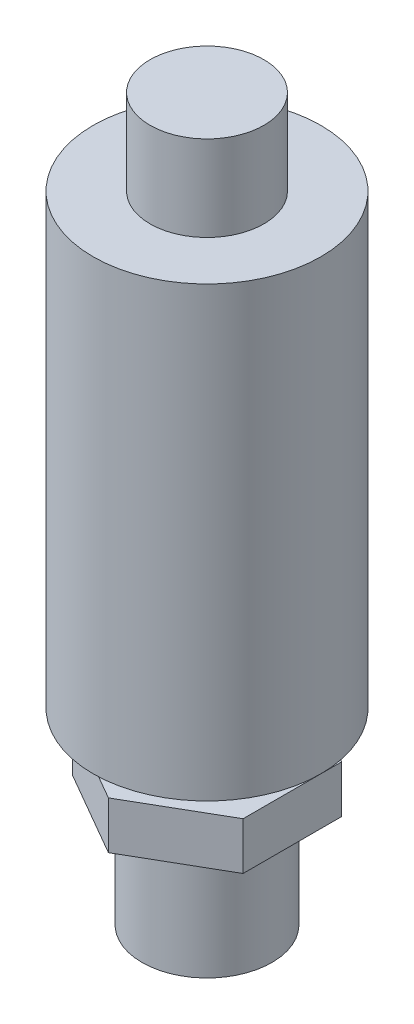
ISO-10303-21;
HEADER;
FILE_DESCRIPTION(('STEP AP214'),'2;1');
FILE_NAME('part.step','',(''),(''),'','','');
FILE_SCHEMA(('AUTOMOTIVE_DESIGN { 1 0 10303 214 1 1 1 1 }'));
ENDSEC;
DATA;
#1=APPLICATION_CONTEXT('core data for automotive mechanical design processes');
#2=APPLICATION_PROTOCOL_DEFINITION('international standard','automotive_design',2000,#1);
#3=PRODUCT_CONTEXT('',#1,'mechanical');
#4=PRODUCT('Part','Part','',(#3));
#5=PRODUCT_RELATED_PRODUCT_CATEGORY('part','',(#4));
#6=PRODUCT_DEFINITION_FORMATION('','',#4);
#7=PRODUCT_DEFINITION_CONTEXT('part definition',#1,'design');
#8=PRODUCT_DEFINITION('design','',#6,#7);
#9=PRODUCT_DEFINITION_SHAPE('','',#8);
#10=(LENGTH_UNIT() NAMED_UNIT(*) SI_UNIT(.MILLI.,.METRE.));
#11=(NAMED_UNIT(*) PLANE_ANGLE_UNIT() SI_UNIT($,.RADIAN.));
#12=(NAMED_UNIT(*) SI_UNIT($,.STERADIAN.) SOLID_ANGLE_UNIT());
#13=UNCERTAINTY_MEASURE_WITH_UNIT(LENGTH_MEASURE(1.E-05),#10,'distance_accuracy_value','');
#14=(GEOMETRIC_REPRESENTATION_CONTEXT(3) GLOBAL_UNCERTAINTY_ASSIGNED_CONTEXT((#13)) GLOBAL_UNIT_ASSIGNED_CONTEXT((#10,
#11,#12)) REPRESENTATION_CONTEXT('',''));
#15=CARTESIAN_POINT('',(0.,0.,0.));
#16=DIRECTION('',(0.,0.,1.));
#17=DIRECTION('',(1.,0.,0.));
#18=AXIS2_PLACEMENT_3D('',#15,#16,#17);
#19=CARTESIAN_POINT('',(0.,11.8,0.));
#20=DIRECTION('',(0.,-1.,0.));
#21=DIRECTION('',(0.,0.,-1.));
#22=AXIS2_PLACEMENT_3D('',#19,#20,#21);
#23=CYLINDRICAL_SURFACE('',#22,6.85);
#24=CARTESIAN_POINT('',(0.,11.8,0.));
#25=DIRECTION('',(0.,1.,0.));
#26=DIRECTION('',(0.,0.,1.));
#27=AXIS2_PLACEMENT_3D('',#24,#25,#26);
#28=CIRCLE('',#27,6.85);
#29=CARTESIAN_POINT('',(0.,11.8,6.85));
#30=VERTEX_POINT('',#29);
#31=EDGE_CURVE('E141',#30,#30,#28,.T.);
#32=ORIENTED_EDGE('',*,*,#31,.F.);
#33=EDGE_LOOP('',(#32));
#34=FACE_BOUND('',#33,.T.);
#35=CARTESIAN_POINT('',(0.,0.,0.));
#36=DIRECTION('',(0.,1.,0.));
#37=DIRECTION('',(0.,0.,1.));
#38=AXIS2_PLACEMENT_3D('',#35,#36,#37);
#39=CIRCLE('',#38,6.85);
#40=CARTESIAN_POINT('',(0.,0.,6.85));
#41=VERTEX_POINT('',#40);
#42=EDGE_CURVE('E38',#41,#41,#39,.T.);
#43=ORIENTED_EDGE('',*,*,#42,.T.);
#44=EDGE_LOOP('',(#43));
#45=FACE_BOUND('',#44,.T.);
#46=ADVANCED_FACE('F35',(#34,#45),#23,.T.);
#47=CARTESIAN_POINT('',(0.,0.,0.));
#48=DIRECTION('',(0.,1.,0.));
#49=DIRECTION('',(0.,0.,1.));
#50=AXIS2_PLACEMENT_3D('',#47,#48,#49);
#51=PLANE('',#50);
#52=ORIENTED_EDGE('',*,*,#42,.F.);
#53=EDGE_LOOP('',(#52));
#54=FACE_BOUND('',#53,.T.);
#55=ADVANCED_FACE('F151',(#54),#51,.F.);
#56=CARTESIAN_POINT('',(8.99999999999995,16.8,-5.19615242270664));
#57=DIRECTION('',(-0.499999999999997,0.,0.866025403784441));
#58=DIRECTION('',(0.866025403784441,0.,0.499999999999997));
#59=AXIS2_PLACEMENT_3D('',#56,#57,#58);
#60=PLANE('',#59);
#61=DIRECTION('',(-0.866025403784441,0.,-0.499999999999997));
#62=VECTOR('',#61,1.);
#63=CARTESIAN_POINT('',(8.99999999999995,11.8,-5.19615242270664));
#64=LINE('',#63,#62);
#65=CARTESIAN_POINT('',(8.99999999999995,11.8,-5.19615242270664));
#66=VERTEX_POINT('',#65);
#67=CARTESIAN_POINT('',(0.,11.8,-10.3923048454132));
#68=VERTEX_POINT('',#67);
#69=EDGE_CURVE('E122',#66,#68,#64,.T.);
#70=ORIENTED_EDGE('',*,*,#69,.T.);
#71=DIRECTION('',(0.,-1.,0.));
#72=VECTOR('',#71,1.);
#73=CARTESIAN_POINT('',(0.,16.8,-10.3923048454132));
#74=LINE('',#73,#72);
#75=CARTESIAN_POINT('',(0.,16.8,-10.3923048454132));
#76=VERTEX_POINT('',#75);
#77=EDGE_CURVE('E140',#76,#68,#74,.T.);
#78=ORIENTED_EDGE('',*,*,#77,.F.);
#79=DIRECTION('',(-0.866025403784441,0.,-0.499999999999997));
#80=VECTOR('',#79,1.);
#81=CARTESIAN_POINT('',(8.99999999999995,16.8,-5.19615242270664));
#82=LINE('',#81,#80);
#83=CARTESIAN_POINT('',(8.99999999999995,16.8,-5.19615242270664));
#84=VERTEX_POINT('',#83);
#85=EDGE_CURVE('E133',#84,#76,#82,.T.);
#86=ORIENTED_EDGE('',*,*,#85,.F.);
#87=DIRECTION('',(0.,-1.,0.));
#88=VECTOR('',#87,1.);
#89=CARTESIAN_POINT('',(8.99999999999995,16.8,-5.19615242270664));
#90=LINE('',#89,#88);
#91=EDGE_CURVE('E118',#84,#66,#90,.T.);
#92=ORIENTED_EDGE('',*,*,#91,.T.);
#93=EDGE_LOOP('',(#70,#78,#86,#92));
#94=FACE_BOUND('',#93,.T.);
#95=ADVANCED_FACE('F153',(#94),#60,.F.);
#96=CARTESIAN_POINT('',(0.,16.8,-10.3923048454132));
#97=DIRECTION('',(0.500000000000004,0.,0.866025403784437));
#98=DIRECTION('',(0.866025403784437,0.,-0.500000000000004));
#99=AXIS2_PLACEMENT_3D('',#96,#97,#98);
#100=PLANE('',#99);
#101=DIRECTION('',(-0.866025403784437,0.,0.500000000000004));
#102=VECTOR('',#101,1.);
#103=CARTESIAN_POINT('',(0.,11.8,-10.3923048454132));
#104=LINE('',#103,#102);
#105=CARTESIAN_POINT('',(-8.99999999999998,11.8,-5.19615242270657));
#106=VERTEX_POINT('',#105);
#107=EDGE_CURVE('E125',#68,#106,#104,.T.);
#108=ORIENTED_EDGE('',*,*,#107,.T.);
#109=DIRECTION('',(0.,-1.,0.));
#110=VECTOR('',#109,1.);
#111=CARTESIAN_POINT('',(-8.99999999999998,16.8,-5.19615242270657));
#112=LINE('',#111,#110);
#113=CARTESIAN_POINT('',(-8.99999999999998,16.8,-5.19615242270657));
#114=VERTEX_POINT('',#113);
#115=EDGE_CURVE('E137',#114,#106,#112,.T.);
#116=ORIENTED_EDGE('',*,*,#115,.F.);
#117=DIRECTION('',(-0.866025403784437,0.,0.500000000000004));
#118=VECTOR('',#117,1.);
#119=CARTESIAN_POINT('',(0.,16.8,-10.3923048454132));
#120=LINE('',#119,#118);
#121=EDGE_CURVE('E91',#76,#114,#120,.T.);
#122=ORIENTED_EDGE('',*,*,#121,.F.);
#123=ORIENTED_EDGE('',*,*,#77,.T.);
#124=EDGE_LOOP('',(#108,#116,#122,#123));
#125=FACE_BOUND('',#124,.T.);
#126=ADVANCED_FACE('F158',(#125),#100,.F.);
#127=CARTESIAN_POINT('',(-8.99999999999998,16.8,-5.19615242270657));
#128=DIRECTION('',(1.,0.,0.));
#129=DIRECTION('',(0.,0.,-1.));
#130=AXIS2_PLACEMENT_3D('',#127,#128,#129);
#131=PLANE('',#130);
#132=DIRECTION('',(0.,0.,1.));
#133=VECTOR('',#132,1.);
#134=CARTESIAN_POINT('',(-8.99999999999998,11.8,-5.19615242270657));
#135=LINE('',#134,#133);
#136=CARTESIAN_POINT('',(-8.99999999999994,11.8,5.19615242270664));
#137=VERTEX_POINT('',#136);
#138=EDGE_CURVE('E128',#106,#137,#135,.T.);
#139=ORIENTED_EDGE('',*,*,#138,.T.);
#140=DIRECTION('',(0.,-1.,0.));
#141=VECTOR('',#140,1.);
#142=CARTESIAN_POINT('',(-8.99999999999994,16.8,5.19615242270664));
#143=LINE('',#142,#141);
#144=CARTESIAN_POINT('',(-8.99999999999994,16.8,5.19615242270664));
#145=VERTEX_POINT('',#144);
#146=EDGE_CURVE('E113',#145,#137,#143,.T.);
#147=ORIENTED_EDGE('',*,*,#146,.F.);
#148=DIRECTION('',(0.,0.,1.));
#149=VECTOR('',#148,1.);
#150=CARTESIAN_POINT('',(-8.99999999999998,16.8,-5.19615242270657));
#151=LINE('',#150,#149);
#152=EDGE_CURVE('E104',#114,#145,#151,.T.);
#153=ORIENTED_EDGE('',*,*,#152,.F.);
#154=ORIENTED_EDGE('',*,*,#115,.T.);
#155=EDGE_LOOP('',(#139,#147,#153,#154));
#156=FACE_BOUND('',#155,.T.);
#157=ADVANCED_FACE('F165',(#156),#131,.F.);
#158=CARTESIAN_POINT('',(-8.99999999999994,16.8,5.19615242270664));
#159=DIRECTION('',(0.499999999999997,0.,-0.866025403784441));
#160=DIRECTION('',(-0.866025403784441,0.,-0.499999999999997));
#161=AXIS2_PLACEMENT_3D('',#158,#159,#160);
#162=PLANE('',#161);
#163=DIRECTION('',(0.866025403784441,0.,0.499999999999997));
#164=VECTOR('',#163,1.);
#165=CARTESIAN_POINT('',(-8.99999999999994,11.8,5.19615242270664));
#166=LINE('',#165,#164);
#167=CARTESIAN_POINT('',(0.,11.8,10.3923048454132));
#168=VERTEX_POINT('',#167);
#169=EDGE_CURVE('E112',#137,#168,#166,.T.);
#170=ORIENTED_EDGE('',*,*,#169,.T.);
#171=DIRECTION('',(0.,-1.,0.));
#172=VECTOR('',#171,1.);
#173=CARTESIAN_POINT('',(0.,16.8,10.3923048454132));
#174=LINE('',#173,#172);
#175=CARTESIAN_POINT('',(0.,16.8,10.3923048454132));
#176=VERTEX_POINT('',#175);
#177=EDGE_CURVE('E109',#176,#168,#174,.T.);
#178=ORIENTED_EDGE('',*,*,#177,.F.);
#179=DIRECTION('',(0.866025403784441,0.,0.499999999999997));
#180=VECTOR('',#179,1.);
#181=CARTESIAN_POINT('',(-8.99999999999994,16.8,5.19615242270664));
#182=LINE('',#181,#180);
#183=EDGE_CURVE('E98',#145,#176,#182,.T.);
#184=ORIENTED_EDGE('',*,*,#183,.F.);
#185=ORIENTED_EDGE('',*,*,#146,.T.);
#186=EDGE_LOOP('',(#170,#178,#184,#185));
#187=FACE_BOUND('',#186,.T.);
#188=ADVANCED_FACE('F110',(#187),#162,.F.);
#189=CARTESIAN_POINT('',(0.,16.8,10.3923048454132));
#190=DIRECTION('',(-0.500000000000004,0.,-0.866025403784437));
#191=DIRECTION('',(-0.866025403784437,0.,0.500000000000004));
#192=AXIS2_PLACEMENT_3D('',#189,#190,#191);
#193=PLANE('',#192);
#194=DIRECTION('',(0.866025403784437,0.,-0.500000000000004));
#195=VECTOR('',#194,1.);
#196=CARTESIAN_POINT('',(0.,11.8,10.3923048454132));
#197=LINE('',#196,#195);
#198=CARTESIAN_POINT('',(8.99999999999999,11.8,5.19615242270657));
#199=VERTEX_POINT('',#198);
#200=EDGE_CURVE('E76',#168,#199,#197,.T.);
#201=ORIENTED_EDGE('',*,*,#200,.T.);
#202=DIRECTION('',(0.,-1.,0.));
#203=VECTOR('',#202,1.);
#204=CARTESIAN_POINT('',(8.99999999999999,16.8,5.19615242270657));
#205=LINE('',#204,#203);
#206=CARTESIAN_POINT('',(8.99999999999999,16.8,5.19615242270657));
#207=VERTEX_POINT('',#206);
#208=EDGE_CURVE('E114',#207,#199,#205,.T.);
#209=ORIENTED_EDGE('',*,*,#208,.F.);
#210=DIRECTION('',(0.866025403784437,0.,-0.500000000000004));
#211=VECTOR('',#210,1.);
#212=CARTESIAN_POINT('',(0.,16.8,10.3923048454132));
#213=LINE('',#212,#211);
#214=EDGE_CURVE('E102',#176,#207,#213,.T.);
#215=ORIENTED_EDGE('',*,*,#214,.F.);
#216=ORIENTED_EDGE('',*,*,#177,.T.);
#217=EDGE_LOOP('',(#201,#209,#215,#216));
#218=FACE_BOUND('',#217,.T.);
#219=ADVANCED_FACE('F116',(#218),#193,.F.);
#220=CARTESIAN_POINT('',(8.99999999999999,16.8,5.19615242270657));
#221=DIRECTION('',(-1.,0.,0.));
#222=DIRECTION('',(0.,0.,1.));
#223=AXIS2_PLACEMENT_3D('',#220,#221,#222);
#224=PLANE('',#223);
#225=DIRECTION('',(0.,0.,-1.));
#226=VECTOR('',#225,1.);
#227=CARTESIAN_POINT('',(8.99999999999999,11.8,5.19615242270657));
#228=LINE('',#227,#226);
#229=EDGE_CURVE('E82',#199,#66,#228,.T.);
#230=ORIENTED_EDGE('',*,*,#229,.T.);
#231=ORIENTED_EDGE('',*,*,#91,.F.);
#232=DIRECTION('',(0.,0.,-1.));
#233=VECTOR('',#232,1.);
#234=CARTESIAN_POINT('',(8.99999999999999,16.8,5.19615242270657));
#235=LINE('',#234,#233);
#236=EDGE_CURVE('E53',#207,#84,#235,.T.);
#237=ORIENTED_EDGE('',*,*,#236,.F.);
#238=ORIENTED_EDGE('',*,*,#208,.T.);
#239=EDGE_LOOP('',(#230,#231,#237,#238));
#240=FACE_BOUND('',#239,.T.);
#241=ADVANCED_FACE('F173',(#240),#224,.F.);
#242=CARTESIAN_POINT('',(0.,16.8,0.));
#243=DIRECTION('',(0.,1.,0.));
#244=DIRECTION('',(0.,0.,1.));
#245=AXIS2_PLACEMENT_3D('',#242,#243,#244);
#246=PLANE('',#245);
#247=CARTESIAN_POINT('',(0.,16.8,0.));
#248=DIRECTION('',(0.,1.,0.));
#249=DIRECTION('',(0.,0.,1.));
#250=AXIS2_PLACEMENT_3D('',#247,#248,#249);
#251=CIRCLE('',#250,5.);
#252=CARTESIAN_POINT('',(0.,16.8,5.));
#253=VERTEX_POINT('',#252);
#254=EDGE_CURVE('E44',#253,#253,#251,.T.);
#255=ORIENTED_EDGE('',*,*,#254,.F.);
#256=EDGE_LOOP('',(#255));
#257=FACE_BOUND('',#256,.T.);
#258=ORIENTED_EDGE('',*,*,#85,.T.);
#259=ORIENTED_EDGE('',*,*,#121,.T.);
#260=ORIENTED_EDGE('',*,*,#152,.T.);
#261=ORIENTED_EDGE('',*,*,#183,.T.);
#262=ORIENTED_EDGE('',*,*,#214,.T.);
#263=ORIENTED_EDGE('',*,*,#236,.T.);
#264=EDGE_LOOP('',(#258,#259,#260,#261,#262,#263));
#265=FACE_BOUND('',#264,.T.);
#266=ADVANCED_FACE('F100',(#257,#265),#246,.T.);
#267=CARTESIAN_POINT('',(0.,11.8,0.));
#268=DIRECTION('',(0.,1.,0.));
#269=DIRECTION('',(0.,0.,1.));
#270=AXIS2_PLACEMENT_3D('',#267,#268,#269);
#271=PLANE('',#270);
#272=ORIENTED_EDGE('',*,*,#31,.T.);
#273=EDGE_LOOP('',(#272));
#274=FACE_BOUND('',#273,.T.);
#275=ORIENTED_EDGE('',*,*,#69,.F.);
#276=ORIENTED_EDGE('',*,*,#229,.F.);
#277=ORIENTED_EDGE('',*,*,#200,.F.);
#278=ORIENTED_EDGE('',*,*,#169,.F.);
#279=ORIENTED_EDGE('',*,*,#138,.F.);
#280=ORIENTED_EDGE('',*,*,#107,.F.);
#281=EDGE_LOOP('',(#275,#276,#277,#278,#279,#280));
#282=FACE_BOUND('',#281,.T.);
#283=ADVANCED_FACE('F176',(#274,#282),#271,.F.);
#284=CARTESIAN_POINT('',(0.,19.8,0.));
#285=DIRECTION('',(0.,-1.,0.));
#286=DIRECTION('',(0.,0.,-1.));
#287=AXIS2_PLACEMENT_3D('',#284,#285,#286);
#288=CYLINDRICAL_SURFACE('',#287,5.);
#289=CARTESIAN_POINT('',(0.,19.8,0.));
#290=DIRECTION('',(0.,1.,0.));
#291=DIRECTION('',(0.,0.,1.));
#292=AXIS2_PLACEMENT_3D('',#289,#290,#291);
#293=CIRCLE('',#292,5.);
#294=CARTESIAN_POINT('',(0.,19.8,5.));
#295=VERTEX_POINT('',#294);
#296=EDGE_CURVE('E126',#295,#295,#293,.T.);
#297=ORIENTED_EDGE('',*,*,#296,.F.);
#298=EDGE_LOOP('',(#297));
#299=FACE_BOUND('',#298,.T.);
#300=ORIENTED_EDGE('',*,*,#254,.T.);
#301=EDGE_LOOP('',(#300));
#302=FACE_BOUND('',#301,.T.);
#303=ADVANCED_FACE('F179',(#299,#302),#288,.T.);
#304=CARTESIAN_POINT('',(0.,67.,0.));
#305=DIRECTION('',(0.,-1.,0.));
#306=DIRECTION('',(0.,0.,-1.));
#307=AXIS2_PLACEMENT_3D('',#304,#305,#306);
#308=CYLINDRICAL_SURFACE('',#307,12.);
#309=CARTESIAN_POINT('',(0.,67.,0.));
#310=DIRECTION('',(0.,1.,0.));
#311=DIRECTION('',(0.,0.,1.));
#312=AXIS2_PLACEMENT_3D('',#309,#310,#311);
#313=CIRCLE('',#312,12.);
#314=CARTESIAN_POINT('',(0.,67.,12.));
#315=VERTEX_POINT('',#314);
#316=EDGE_CURVE('E213',#315,#315,#313,.T.);
#317=ORIENTED_EDGE('',*,*,#316,.F.);
#318=EDGE_LOOP('',(#317));
#319=FACE_BOUND('',#318,.T.);
#320=CARTESIAN_POINT('',(0.,19.8,0.));
#321=DIRECTION('',(0.,1.,0.));
#322=DIRECTION('',(0.,0.,1.));
#323=AXIS2_PLACEMENT_3D('',#320,#321,#322);
#324=CIRCLE('',#323,12.);
#325=CARTESIAN_POINT('',(0.,19.8,12.));
#326=VERTEX_POINT('',#325);
#327=EDGE_CURVE('E210',#326,#326,#324,.T.);
#328=ORIENTED_EDGE('',*,*,#327,.T.);
#329=EDGE_LOOP('',(#328));
#330=FACE_BOUND('',#329,.T.);
#331=ADVANCED_FACE('F185',(#319,#330),#308,.T.);
#332=CARTESIAN_POINT('',(0.,67.,0.));
#333=DIRECTION('',(0.,1.,0.));
#334=DIRECTION('',(0.,0.,1.));
#335=AXIS2_PLACEMENT_3D('',#332,#333,#334);
#336=PLANE('',#335);
#337=CARTESIAN_POINT('',(0.,67.,0.));
#338=DIRECTION('',(0.,1.,0.));
#339=DIRECTION('',(0.,0.,1.));
#340=AXIS2_PLACEMENT_3D('',#337,#338,#339);
#341=CIRCLE('',#340,6.);
#342=CARTESIAN_POINT('',(0.,67.,6.));
#343=VERTEX_POINT('',#342);
#344=EDGE_CURVE('E11',#343,#343,#341,.T.);
#345=ORIENTED_EDGE('',*,*,#344,.F.);
#346=EDGE_LOOP('',(#345));
#347=FACE_BOUND('',#346,.T.);
#348=ORIENTED_EDGE('',*,*,#316,.T.);
#349=EDGE_LOOP('',(#348));
#350=FACE_BOUND('',#349,.T.);
#351=ADVANCED_FACE('F189',(#347,#350),#336,.T.);
#352=CARTESIAN_POINT('',(0.,19.8,0.));
#353=DIRECTION('',(0.,1.,0.));
#354=DIRECTION('',(0.,0.,1.));
#355=AXIS2_PLACEMENT_3D('',#352,#353,#354);
#356=PLANE('',#355);
#357=ORIENTED_EDGE('',*,*,#296,.T.);
#358=EDGE_LOOP('',(#357));
#359=FACE_BOUND('',#358,.T.);
#360=ORIENTED_EDGE('',*,*,#327,.F.);
#361=EDGE_LOOP('',(#360));
#362=FACE_BOUND('',#361,.T.);
#363=ADVANCED_FACE('F191',(#359,#362),#356,.F.);
#364=CARTESIAN_POINT('',(0.,76.,0.));
#365=DIRECTION('',(0.,-1.,0.));
#366=DIRECTION('',(0.,0.,-1.));
#367=AXIS2_PLACEMENT_3D('',#364,#365,#366);
#368=CYLINDRICAL_SURFACE('',#367,6.);
#369=CARTESIAN_POINT('',(0.,76.,0.));
#370=DIRECTION('',(0.,1.,0.));
#371=DIRECTION('',(0.,0.,1.));
#372=AXIS2_PLACEMENT_3D('',#369,#370,#371);
#373=CIRCLE('',#372,6.);
#374=CARTESIAN_POINT('',(0.,76.,6.));
#375=VERTEX_POINT('',#374);
#376=EDGE_CURVE('E209',#375,#375,#373,.T.);
#377=ORIENTED_EDGE('',*,*,#376,.F.);
#378=EDGE_LOOP('',(#377));
#379=FACE_BOUND('',#378,.T.);
#380=ORIENTED_EDGE('',*,*,#344,.T.);
#381=EDGE_LOOP('',(#380));
#382=FACE_BOUND('',#381,.T.);
#383=ADVANCED_FACE('F194',(#379,#382),#368,.T.);
#384=CARTESIAN_POINT('',(0.,76.,0.));
#385=DIRECTION('',(0.,1.,0.));
#386=DIRECTION('',(0.,0.,1.));
#387=AXIS2_PLACEMENT_3D('',#384,#385,#386);
#388=PLANE('',#387);
#389=ORIENTED_EDGE('',*,*,#376,.T.);
#390=EDGE_LOOP('',(#389));
#391=FACE_BOUND('',#390,.T.);
#392=ADVANCED_FACE('F201',(#391),#388,.T.);
#393=CLOSED_SHELL('',(#46,#55,#95,#126,#157,#188,#219,#241,#266,#283,#303,#331,#351,#363,#383,#392));
#394=MANIFOLD_SOLID_BREP('B2',#393);
#395=ADVANCED_BREP_SHAPE_REPRESENTATION('',(#18,#394),#14);
#396=SHAPE_DEFINITION_REPRESENTATION(#9,#395);
ENDSEC;
END-ISO-10303-21;
